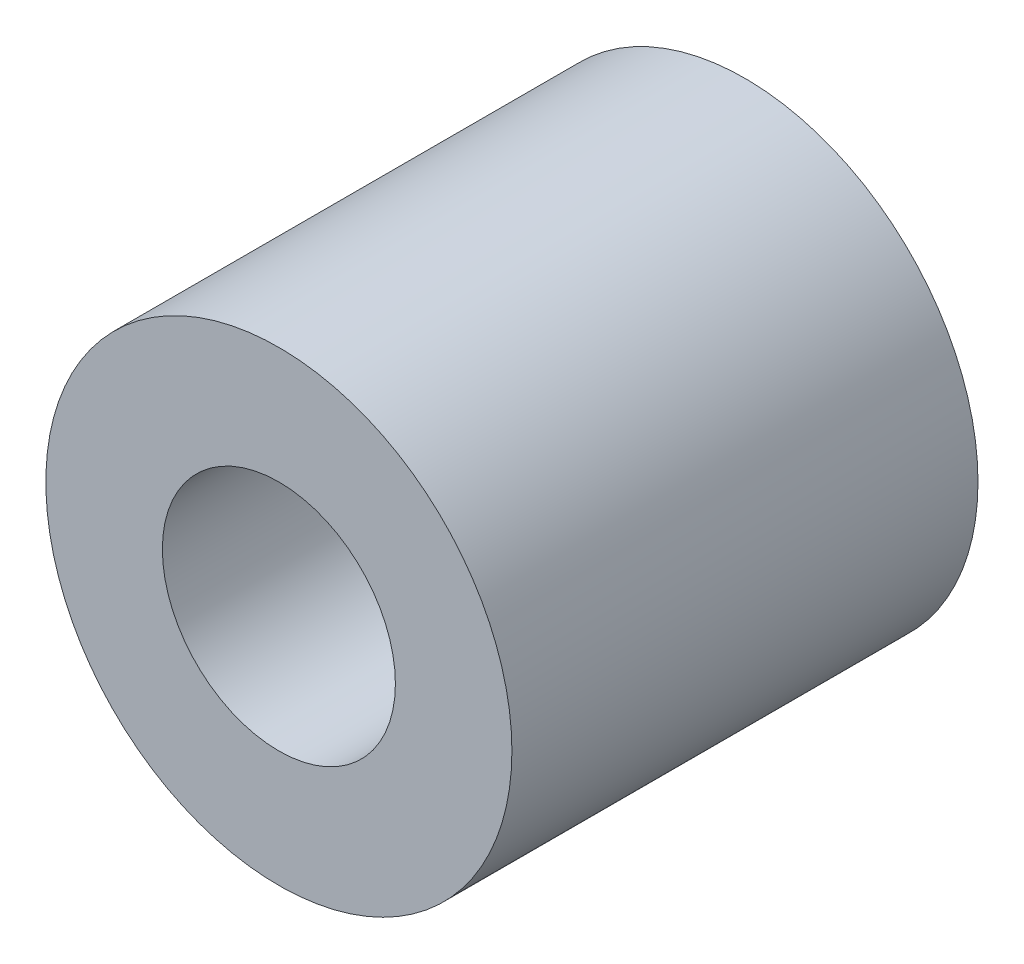
ISO-10303-21;
HEADER;
FILE_DESCRIPTION(('STEP AP214'),'2;1');
FILE_NAME('part.step','',(''),(''),'','','');
FILE_SCHEMA(('AUTOMOTIVE_DESIGN { 1 0 10303 214 1 1 1 1 }'));
ENDSEC;
DATA;
#1=APPLICATION_CONTEXT('core data for automotive mechanical design processes');
#2=APPLICATION_PROTOCOL_DEFINITION('international standard','automotive_design',2000,#1);
#3=PRODUCT_CONTEXT('',#1,'mechanical');
#4=PRODUCT('Part','Part','',(#3));
#5=PRODUCT_RELATED_PRODUCT_CATEGORY('part','',(#4));
#6=PRODUCT_DEFINITION_FORMATION('','',#4);
#7=PRODUCT_DEFINITION_CONTEXT('part definition',#1,'design');
#8=PRODUCT_DEFINITION('design','',#6,#7);
#9=PRODUCT_DEFINITION_SHAPE('','',#8);
#10=(LENGTH_UNIT() NAMED_UNIT(*) SI_UNIT(.MILLI.,.METRE.));
#11=(NAMED_UNIT(*) PLANE_ANGLE_UNIT() SI_UNIT($,.RADIAN.));
#12=(NAMED_UNIT(*) SI_UNIT($,.STERADIAN.) SOLID_ANGLE_UNIT());
#13=UNCERTAINTY_MEASURE_WITH_UNIT(LENGTH_MEASURE(1.E-05),#10,'distance_accuracy_value','');
#14=(GEOMETRIC_REPRESENTATION_CONTEXT(3) GLOBAL_UNCERTAINTY_ASSIGNED_CONTEXT((#13)) GLOBAL_UNIT_ASSIGNED_CONTEXT((#10,
#11,#12)) REPRESENTATION_CONTEXT('',''));
#15=CARTESIAN_POINT('',(0.,0.,0.));
#16=DIRECTION('',(0.,0.,1.));
#17=DIRECTION('',(1.,0.,0.));
#18=AXIS2_PLACEMENT_3D('',#15,#16,#17);
#19=CARTESIAN_POINT('',(0.,0.,3.175));
#20=DIRECTION('',(0.,0.,1.));
#21=DIRECTION('',(1.,0.,0.));
#22=AXIS2_PLACEMENT_3D('',#19,#20,#21);
#23=PLANE('',#22);
#24=CARTESIAN_POINT('',(0.,0.,3.175));
#25=DIRECTION('',(0.,0.,1.));
#26=DIRECTION('',(1.,0.,0.));
#27=AXIS2_PLACEMENT_3D('',#24,#25,#26);
#28=CIRCLE('',#27,3.175);
#29=CARTESIAN_POINT('',(3.175,0.,3.175));
#30=VERTEX_POINT('',#29);
#31=EDGE_CURVE('E10',#30,#30,#28,.T.);
#32=ORIENTED_EDGE('',*,*,#31,.T.);
#33=EDGE_LOOP('',(#32));
#34=FACE_BOUND('',#33,.T.);
#35=CARTESIAN_POINT('',(0.,0.,3.175));
#36=DIRECTION('',(0.,0.,1.));
#37=DIRECTION('',(1.,0.,0.));
#38=AXIS2_PLACEMENT_3D('',#35,#36,#37);
#39=CIRCLE('',#38,1.5875);
#40=CARTESIAN_POINT('',(1.5875,0.,3.175));
#41=VERTEX_POINT('',#40);
#42=EDGE_CURVE('E43',#41,#41,#39,.T.);
#43=ORIENTED_EDGE('',*,*,#42,.F.);
#44=EDGE_LOOP('',(#43));
#45=FACE_BOUND('',#44,.T.);
#46=ADVANCED_FACE('F32',(#34,#45),#23,.T.);
#47=CARTESIAN_POINT('',(0.,0.,-3.175));
#48=DIRECTION('',(0.,0.,1.));
#49=DIRECTION('',(1.,0.,0.));
#50=AXIS2_PLACEMENT_3D('',#47,#48,#49);
#51=PLANE('',#50);
#52=CARTESIAN_POINT('',(0.,0.,-3.175));
#53=DIRECTION('',(0.,0.,1.));
#54=DIRECTION('',(1.,0.,0.));
#55=AXIS2_PLACEMENT_3D('',#52,#53,#54);
#56=CIRCLE('',#55,3.175);
#57=CARTESIAN_POINT('',(3.175,0.,-3.175));
#58=VERTEX_POINT('',#57);
#59=EDGE_CURVE('E36',#58,#58,#56,.T.);
#60=ORIENTED_EDGE('',*,*,#59,.F.);
#61=EDGE_LOOP('',(#60));
#62=FACE_BOUND('',#61,.T.);
#63=CARTESIAN_POINT('',(0.,0.,-3.175));
#64=DIRECTION('',(0.,0.,1.));
#65=DIRECTION('',(1.,0.,0.));
#66=AXIS2_PLACEMENT_3D('',#63,#64,#65);
#67=CIRCLE('',#66,1.5875);
#68=CARTESIAN_POINT('',(1.5875,0.,-3.175));
#69=VERTEX_POINT('',#68);
#70=EDGE_CURVE('E45',#69,#69,#67,.T.);
#71=ORIENTED_EDGE('',*,*,#70,.T.);
#72=EDGE_LOOP('',(#71));
#73=FACE_BOUND('',#72,.T.);
#74=ADVANCED_FACE('F55',(#62,#73),#51,.F.);
#75=CARTESIAN_POINT('',(0.,0.,3.175));
#76=DIRECTION('',(0.,0.,-1.));
#77=DIRECTION('',(-1.,0.,0.));
#78=AXIS2_PLACEMENT_3D('',#75,#76,#77);
#79=CYLINDRICAL_SURFACE('',#78,3.175);
#80=ORIENTED_EDGE('',*,*,#31,.F.);
#81=EDGE_LOOP('',(#80));
#82=FACE_BOUND('',#81,.T.);
#83=ORIENTED_EDGE('',*,*,#59,.T.);
#84=EDGE_LOOP('',(#83));
#85=FACE_BOUND('',#84,.T.);
#86=ADVANCED_FACE('F34',(#82,#85),#79,.T.);
#87=CARTESIAN_POINT('',(0.,0.,3.175));
#88=DIRECTION('',(0.,0.,-1.));
#89=DIRECTION('',(-1.,0.,0.));
#90=AXIS2_PLACEMENT_3D('',#87,#88,#89);
#91=CYLINDRICAL_SURFACE('',#90,1.5875);
#92=ORIENTED_EDGE('',*,*,#42,.T.);
#93=EDGE_LOOP('',(#92));
#94=FACE_BOUND('',#93,.T.);
#95=ORIENTED_EDGE('',*,*,#70,.F.);
#96=EDGE_LOOP('',(#95));
#97=FACE_BOUND('',#96,.T.);
#98=ADVANCED_FACE('F51',(#94,#97),#91,.F.);
#99=CLOSED_SHELL('',(#46,#74,#86,#98));
#100=MANIFOLD_SOLID_BREP('B2',#99);
#101=ADVANCED_BREP_SHAPE_REPRESENTATION('',(#18,#100),#14);
#102=SHAPE_DEFINITION_REPRESENTATION(#9,#101);
ENDSEC;
END-ISO-10303-21;
